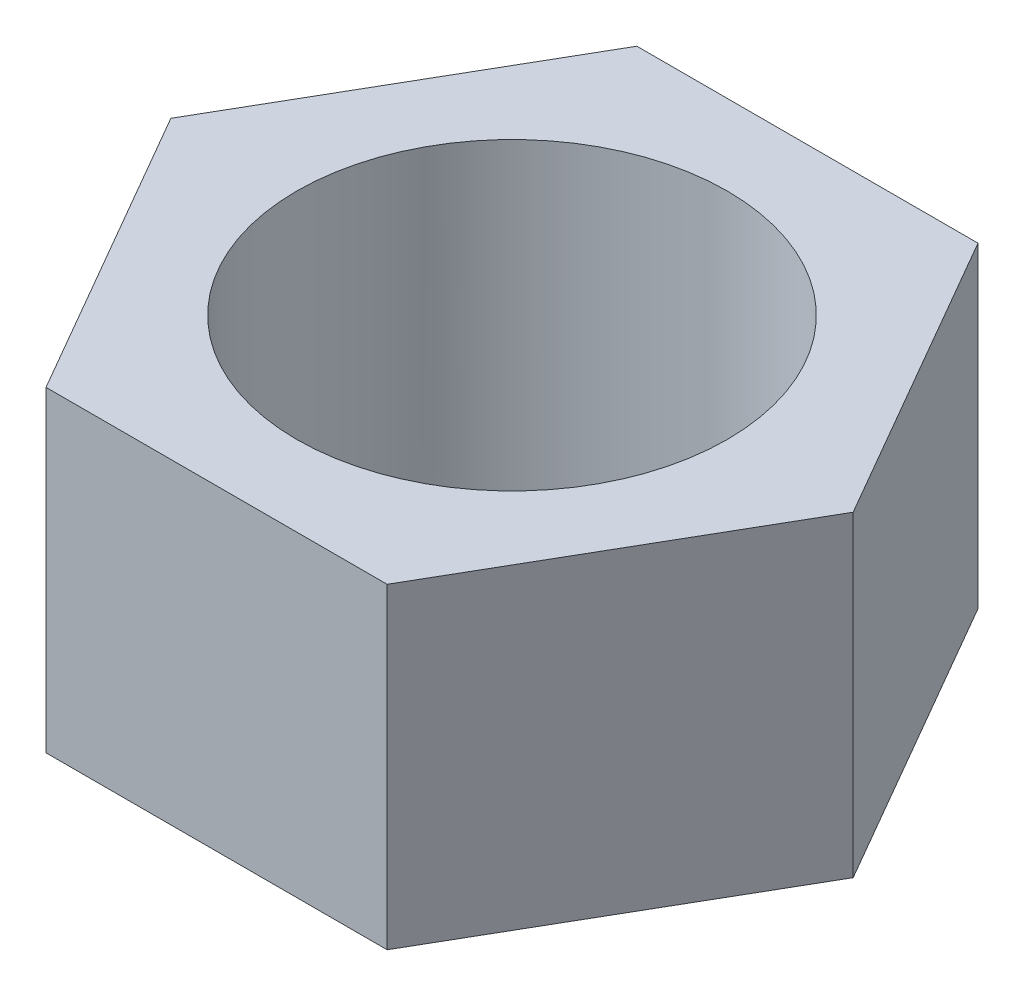
ISO-10303-21;
HEADER;
FILE_DESCRIPTION(('STEP AP214'),'2;1');
FILE_NAME('part.step','',(''),(''),'','','');
FILE_SCHEMA(('AUTOMOTIVE_DESIGN { 1 0 10303 214 1 1 1 1 }'));
ENDSEC;
DATA;
#1=APPLICATION_CONTEXT('core data for automotive mechanical design processes');
#2=APPLICATION_PROTOCOL_DEFINITION('international standard','automotive_design',2000,#1);
#3=PRODUCT_CONTEXT('',#1,'mechanical');
#4=PRODUCT('Part','Part','',(#3));
#5=PRODUCT_RELATED_PRODUCT_CATEGORY('part','',(#4));
#6=PRODUCT_DEFINITION_FORMATION('','',#4);
#7=PRODUCT_DEFINITION_CONTEXT('part definition',#1,'design');
#8=PRODUCT_DEFINITION('design','',#6,#7);
#9=PRODUCT_DEFINITION_SHAPE('','',#8);
#10=(LENGTH_UNIT() NAMED_UNIT(*) SI_UNIT(.MILLI.,.METRE.));
#11=(NAMED_UNIT(*) PLANE_ANGLE_UNIT() SI_UNIT($,.RADIAN.));
#12=(NAMED_UNIT(*) SI_UNIT($,.STERADIAN.) SOLID_ANGLE_UNIT());
#13=UNCERTAINTY_MEASURE_WITH_UNIT(LENGTH_MEASURE(1.E-05),#10,'distance_accuracy_value','');
#14=(GEOMETRIC_REPRESENTATION_CONTEXT(3) GLOBAL_UNCERTAINTY_ASSIGNED_CONTEXT((#13)) GLOBAL_UNIT_ASSIGNED_CONTEXT((#10,
#11,#12)) REPRESENTATION_CONTEXT('',''));
#15=CARTESIAN_POINT('',(0.,0.,0.));
#16=DIRECTION('',(0.,0.,1.));
#17=DIRECTION('',(1.,0.,0.));
#18=AXIS2_PLACEMENT_3D('',#15,#16,#17);
#19=CARTESIAN_POINT('',(2.02072594216369,3.75,3.5));
#20=DIRECTION('',(-0.866025403784439,0.,-0.499999999999999));
#21=DIRECTION('',(-0.5,0.,0.866025403784439));
#22=AXIS2_PLACEMENT_3D('',#19,#20,#21);
#23=PLANE('',#22);
#24=DIRECTION('',(0.5,0.,-0.866025403784439));
#25=VECTOR('',#24,1.);
#26=CARTESIAN_POINT('',(2.02072594216369,0.,3.5));
#27=LINE('',#26,#25);
#28=CARTESIAN_POINT('',(2.02072594216369,0.,3.5));
#29=VERTEX_POINT('',#28);
#30=CARTESIAN_POINT('',(4.04145188432738,0.,0.));
#31=VERTEX_POINT('',#30);
#32=EDGE_CURVE('E124',#29,#31,#27,.T.);
#33=ORIENTED_EDGE('',*,*,#32,.T.);
#34=DIRECTION('',(0.,-1.,0.));
#35=VECTOR('',#34,1.);
#36=CARTESIAN_POINT('',(4.04145188432738,3.75,0.));
#37=LINE('',#36,#35);
#38=CARTESIAN_POINT('',(4.04145188432738,3.75,0.));
#39=VERTEX_POINT('',#38);
#40=EDGE_CURVE('E11',#39,#31,#37,.T.);
#41=ORIENTED_EDGE('',*,*,#40,.F.);
#42=DIRECTION('',(0.5,0.,-0.866025403784439));
#43=VECTOR('',#42,1.);
#44=CARTESIAN_POINT('',(2.02072594216369,3.75,3.5));
#45=LINE('',#44,#43);
#46=CARTESIAN_POINT('',(2.02072594216369,3.75,3.5));
#47=VERTEX_POINT('',#46);
#48=EDGE_CURVE('E140',#47,#39,#45,.T.);
#49=ORIENTED_EDGE('',*,*,#48,.F.);
#50=DIRECTION('',(0.,-1.,0.));
#51=VECTOR('',#50,1.);
#52=CARTESIAN_POINT('',(2.02072594216369,3.75,3.5));
#53=LINE('',#52,#51);
#54=EDGE_CURVE('E120',#47,#29,#53,.T.);
#55=ORIENTED_EDGE('',*,*,#54,.T.);
#56=EDGE_LOOP('',(#33,#41,#49,#55));
#57=FACE_BOUND('',#56,.T.);
#58=ADVANCED_FACE('F34',(#57),#23,.F.);
#59=CARTESIAN_POINT('',(4.04145188432738,3.75,0.));
#60=DIRECTION('',(-0.866025403784438,0.,0.5));
#61=DIRECTION('',(0.5,0.,0.866025403784439));
#62=AXIS2_PLACEMENT_3D('',#59,#60,#61);
#63=PLANE('',#62);
#64=DIRECTION('',(-0.5,0.,-0.866025403784439));
#65=VECTOR('',#64,1.);
#66=CARTESIAN_POINT('',(4.04145188432738,0.,0.));
#67=LINE('',#66,#65);
#68=CARTESIAN_POINT('',(2.02072594216369,0.,-3.5));
#69=VERTEX_POINT('',#68);
#70=EDGE_CURVE('E127',#31,#69,#67,.T.);
#71=ORIENTED_EDGE('',*,*,#70,.T.);
#72=DIRECTION('',(0.,-1.,0.));
#73=VECTOR('',#72,1.);
#74=CARTESIAN_POINT('',(2.02072594216369,3.75,-3.5));
#75=LINE('',#74,#73);
#76=CARTESIAN_POINT('',(2.02072594216369,3.75,-3.5));
#77=VERTEX_POINT('',#76);
#78=EDGE_CURVE('E43',#77,#69,#75,.T.);
#79=ORIENTED_EDGE('',*,*,#78,.F.);
#80=DIRECTION('',(-0.5,0.,-0.866025403784439));
#81=VECTOR('',#80,1.);
#82=CARTESIAN_POINT('',(4.04145188432738,3.75,0.));
#83=LINE('',#82,#81);
#84=EDGE_CURVE('E88',#39,#77,#83,.T.);
#85=ORIENTED_EDGE('',*,*,#84,.F.);
#86=ORIENTED_EDGE('',*,*,#40,.T.);
#87=EDGE_LOOP('',(#71,#79,#85,#86));
#88=FACE_BOUND('',#87,.T.);
#89=ADVANCED_FACE('F169',(#88),#63,.F.);
#90=CARTESIAN_POINT('',(2.02072594216369,3.75,-3.5));
#91=DIRECTION('',(0.,0.,1.));
#92=DIRECTION('',(1.,0.,0.));
#93=AXIS2_PLACEMENT_3D('',#90,#91,#92);
#94=PLANE('',#93);
#95=DIRECTION('',(-1.,0.,0.));
#96=VECTOR('',#95,1.);
#97=CARTESIAN_POINT('',(2.02072594216369,0.,-3.5));
#98=LINE('',#97,#96);
#99=CARTESIAN_POINT('',(-2.02072594216369,0.,-3.5));
#100=VERTEX_POINT('',#99);
#101=EDGE_CURVE('E131',#69,#100,#98,.T.);
#102=ORIENTED_EDGE('',*,*,#101,.T.);
#103=DIRECTION('',(0.,-1.,0.));
#104=VECTOR('',#103,1.);
#105=CARTESIAN_POINT('',(-2.02072594216369,3.75,-3.5));
#106=LINE('',#105,#104);
#107=CARTESIAN_POINT('',(-2.02072594216369,3.75,-3.5));
#108=VERTEX_POINT('',#107);
#109=EDGE_CURVE('E112',#108,#100,#106,.T.);
#110=ORIENTED_EDGE('',*,*,#109,.F.);
#111=DIRECTION('',(-1.,0.,0.));
#112=VECTOR('',#111,1.);
#113=CARTESIAN_POINT('',(2.02072594216369,3.75,-3.5));
#114=LINE('',#113,#112);
#115=EDGE_CURVE('E101',#77,#108,#114,.T.);
#116=ORIENTED_EDGE('',*,*,#115,.F.);
#117=ORIENTED_EDGE('',*,*,#78,.T.);
#118=EDGE_LOOP('',(#102,#110,#116,#117));
#119=FACE_BOUND('',#118,.T.);
#120=ADVANCED_FACE('F150',(#119),#94,.F.);
#121=CARTESIAN_POINT('',(-2.02072594216369,3.75,-3.5));
#122=DIRECTION('',(0.866025403784439,0.,0.5));
#123=DIRECTION('',(0.5,0.,-0.866025403784439));
#124=AXIS2_PLACEMENT_3D('',#121,#122,#123);
#125=PLANE('',#124);
#126=DIRECTION('',(-0.5,0.,0.866025403784439));
#127=VECTOR('',#126,1.);
#128=CARTESIAN_POINT('',(-2.02072594216369,0.,-3.5));
#129=LINE('',#128,#127);
#130=CARTESIAN_POINT('',(-4.04145188432738,0.,0.));
#131=VERTEX_POINT('',#130);
#132=EDGE_CURVE('E110',#100,#131,#129,.T.);
#133=ORIENTED_EDGE('',*,*,#132,.T.);
#134=DIRECTION('',(0.,-1.,0.));
#135=VECTOR('',#134,1.);
#136=CARTESIAN_POINT('',(-4.04145188432738,3.75,0.));
#137=LINE('',#136,#135);
#138=CARTESIAN_POINT('',(-4.04145188432738,3.75,0.));
#139=VERTEX_POINT('',#138);
#140=EDGE_CURVE('E107',#139,#131,#137,.T.);
#141=ORIENTED_EDGE('',*,*,#140,.F.);
#142=DIRECTION('',(-0.5,0.,0.866025403784439));
#143=VECTOR('',#142,1.);
#144=CARTESIAN_POINT('',(-2.02072594216369,3.75,-3.5));
#145=LINE('',#144,#143);
#146=EDGE_CURVE('E95',#108,#139,#145,.T.);
#147=ORIENTED_EDGE('',*,*,#146,.F.);
#148=ORIENTED_EDGE('',*,*,#109,.T.);
#149=EDGE_LOOP('',(#133,#141,#147,#148));
#150=FACE_BOUND('',#149,.T.);
#151=ADVANCED_FACE('F108',(#150),#125,.F.);
#152=CARTESIAN_POINT('',(-4.04145188432738,3.75,0.));
#153=DIRECTION('',(0.866025403784439,0.,-0.5));
#154=DIRECTION('',(-0.5,0.,-0.866025403784439));
#155=AXIS2_PLACEMENT_3D('',#152,#153,#154);
#156=PLANE('',#155);
#157=DIRECTION('',(0.5,0.,0.866025403784439));
#158=VECTOR('',#157,1.);
#159=CARTESIAN_POINT('',(-4.04145188432738,0.,0.));
#160=LINE('',#159,#158);
#161=CARTESIAN_POINT('',(-2.02072594216369,0.,3.5));
#162=VERTEX_POINT('',#161);
#163=EDGE_CURVE('E74',#131,#162,#160,.T.);
#164=ORIENTED_EDGE('',*,*,#163,.T.);
#165=DIRECTION('',(0.,-1.,0.));
#166=VECTOR('',#165,1.);
#167=CARTESIAN_POINT('',(-2.02072594216369,3.75,3.5));
#168=LINE('',#167,#166);
#169=CARTESIAN_POINT('',(-2.02072594216369,3.75,3.5));
#170=VERTEX_POINT('',#169);
#171=EDGE_CURVE('E113',#170,#162,#168,.T.);
#172=ORIENTED_EDGE('',*,*,#171,.F.);
#173=DIRECTION('',(0.5,0.,0.866025403784439));
#174=VECTOR('',#173,1.);
#175=CARTESIAN_POINT('',(-4.04145188432738,3.75,0.));
#176=LINE('',#175,#174);
#177=EDGE_CURVE('E99',#139,#170,#176,.T.);
#178=ORIENTED_EDGE('',*,*,#177,.F.);
#179=ORIENTED_EDGE('',*,*,#140,.T.);
#180=EDGE_LOOP('',(#164,#172,#178,#179));
#181=FACE_BOUND('',#180,.T.);
#182=ADVANCED_FACE('F115',(#181),#156,.F.);
#183=CARTESIAN_POINT('',(-2.02072594216369,3.75,3.5));
#184=DIRECTION('',(0.,0.,-1.));
#185=DIRECTION('',(-1.,0.,0.));
#186=AXIS2_PLACEMENT_3D('',#183,#184,#185);
#187=PLANE('',#186);
#188=DIRECTION('',(1.,0.,0.));
#189=VECTOR('',#188,1.);
#190=CARTESIAN_POINT('',(-2.02072594216369,0.,3.5));
#191=LINE('',#190,#189);
#192=EDGE_CURVE('E80',#162,#29,#191,.T.);
#193=ORIENTED_EDGE('',*,*,#192,.T.);
#194=ORIENTED_EDGE('',*,*,#54,.F.);
#195=DIRECTION('',(1.,0.,0.));
#196=VECTOR('',#195,1.);
#197=CARTESIAN_POINT('',(-2.02072594216369,3.75,3.5));
#198=LINE('',#197,#196);
#199=EDGE_CURVE('E51',#170,#47,#198,.T.);
#200=ORIENTED_EDGE('',*,*,#199,.F.);
#201=ORIENTED_EDGE('',*,*,#171,.T.);
#202=EDGE_LOOP('',(#193,#194,#200,#201));
#203=FACE_BOUND('',#202,.T.);
#204=ADVANCED_FACE('F157',(#203),#187,.F.);
#205=CARTESIAN_POINT('',(0.,3.75,0.));
#206=DIRECTION('',(0.,1.,0.));
#207=DIRECTION('',(0.,0.,1.));
#208=AXIS2_PLACEMENT_3D('',#205,#206,#207);
#209=PLANE('',#208);
#210=CARTESIAN_POINT('',(0.,3.75,0.));
#211=DIRECTION('',(0.,1.,0.));
#212=DIRECTION('',(0.,0.,1.));
#213=AXIS2_PLACEMENT_3D('',#210,#211,#212);
#214=CIRCLE('',#213,2.55);
#215=CARTESIAN_POINT('',(0.,3.75,2.55));
#216=VERTEX_POINT('',#215);
#217=EDGE_CURVE('E128',#216,#216,#214,.T.);
#218=ORIENTED_EDGE('',*,*,#217,.F.);
#219=EDGE_LOOP('',(#218));
#220=FACE_BOUND('',#219,.T.);
#221=ORIENTED_EDGE('',*,*,#48,.T.);
#222=ORIENTED_EDGE('',*,*,#84,.T.);
#223=ORIENTED_EDGE('',*,*,#115,.T.);
#224=ORIENTED_EDGE('',*,*,#146,.T.);
#225=ORIENTED_EDGE('',*,*,#177,.T.);
#226=ORIENTED_EDGE('',*,*,#199,.T.);
#227=EDGE_LOOP('',(#221,#222,#223,#224,#225,#226));
#228=FACE_BOUND('',#227,.T.);
#229=ADVANCED_FACE('F97',(#220,#228),#209,.T.);
#230=CARTESIAN_POINT('',(0.,0.,0.));
#231=DIRECTION('',(0.,1.,0.));
#232=DIRECTION('',(0.,0.,1.));
#233=AXIS2_PLACEMENT_3D('',#230,#231,#232);
#234=PLANE('',#233);
#235=CARTESIAN_POINT('',(0.,0.,0.));
#236=DIRECTION('',(0.,-1.,0.));
#237=DIRECTION('',(0.,0.,-1.));
#238=AXIS2_PLACEMENT_3D('',#235,#236,#237);
#239=CIRCLE('',#238,2.55);
#240=CARTESIAN_POINT('',(0.,0.,-2.55));
#241=VERTEX_POINT('',#240);
#242=EDGE_CURVE('E224',#241,#241,#239,.T.);
#243=ORIENTED_EDGE('',*,*,#242,.F.);
#244=EDGE_LOOP('',(#243));
#245=FACE_BOUND('',#244,.T.);
#246=ORIENTED_EDGE('',*,*,#32,.F.);
#247=ORIENTED_EDGE('',*,*,#192,.F.);
#248=ORIENTED_EDGE('',*,*,#163,.F.);
#249=ORIENTED_EDGE('',*,*,#132,.F.);
#250=ORIENTED_EDGE('',*,*,#101,.F.);
#251=ORIENTED_EDGE('',*,*,#70,.F.);
#252=EDGE_LOOP('',(#246,#247,#248,#249,#250,#251));
#253=FACE_BOUND('',#252,.T.);
#254=ADVANCED_FACE('F153',(#245,#253),#234,.F.);
#255=CARTESIAN_POINT('',(0.,10.,0.));
#256=DIRECTION('',(0.,-1.,0.));
#257=DIRECTION('',(0.,0.,-1.));
#258=AXIS2_PLACEMENT_3D('',#255,#256,#257);
#259=CYLINDRICAL_SURFACE('',#258,2.55);
#260=ORIENTED_EDGE('',*,*,#217,.T.);
#261=EDGE_LOOP('',(#260));
#262=FACE_BOUND('',#261,.T.);
#263=ORIENTED_EDGE('',*,*,#242,.T.);
#264=EDGE_LOOP('',(#263));
#265=FACE_BOUND('',#264,.T.);
#266=ADVANCED_FACE('F206',(#262,#265),#259,.F.);
#267=CLOSED_SHELL('',(#58,#89,#120,#151,#182,#204,#229,#254,#266));
#268=MANIFOLD_SOLID_BREP('B2',#267);
#269=ADVANCED_BREP_SHAPE_REPRESENTATION('',(#18,#268),#14);
#270=SHAPE_DEFINITION_REPRESENTATION(#9,#269);
ENDSEC;
END-ISO-10303-21;
